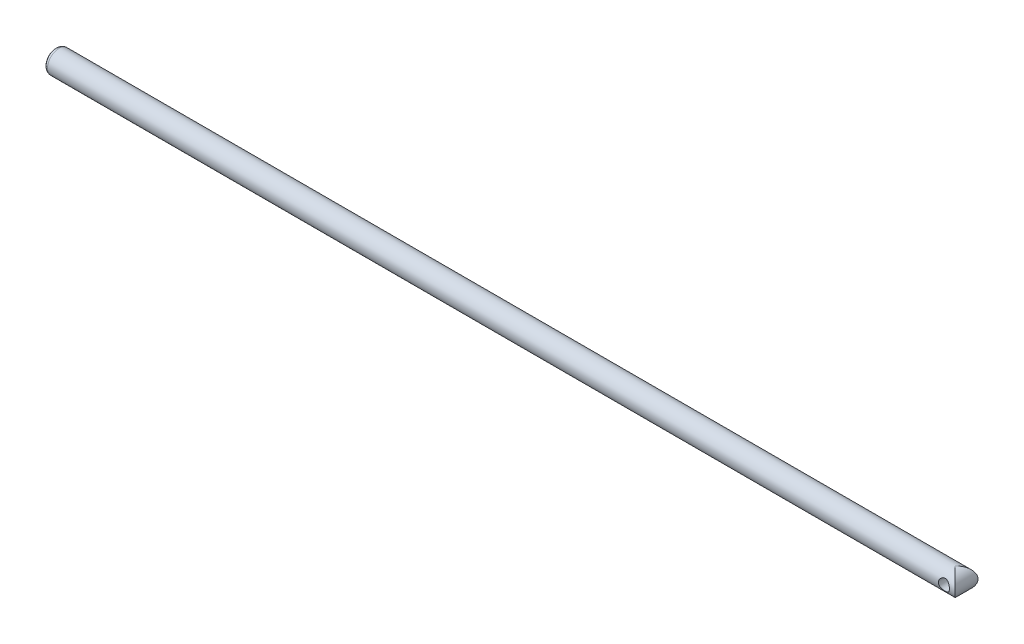
ISO-10303-21;
HEADER;
FILE_DESCRIPTION(('STEP AP214'),'2;1');
FILE_NAME('part.step','',(''),(''),'','','');
FILE_SCHEMA(('AUTOMOTIVE_DESIGN { 1 0 10303 214 1 1 1 1 }'));
ENDSEC;
DATA;
#1=APPLICATION_CONTEXT('core data for automotive mechanical design processes');
#2=APPLICATION_PROTOCOL_DEFINITION('international standard','automotive_design',2000,#1);
#3=PRODUCT_CONTEXT('',#1,'mechanical');
#4=PRODUCT('Part','Part','',(#3));
#5=PRODUCT_RELATED_PRODUCT_CATEGORY('part','',(#4));
#6=PRODUCT_DEFINITION_FORMATION('','',#4);
#7=PRODUCT_DEFINITION_CONTEXT('part definition',#1,'design');
#8=PRODUCT_DEFINITION('design','',#6,#7);
#9=PRODUCT_DEFINITION_SHAPE('','',#8);
#10=(LENGTH_UNIT() NAMED_UNIT(*) SI_UNIT(.MILLI.,.METRE.));
#11=(NAMED_UNIT(*) PLANE_ANGLE_UNIT() SI_UNIT($,.RADIAN.));
#12=(NAMED_UNIT(*) SI_UNIT($,.STERADIAN.) SOLID_ANGLE_UNIT());
#13=UNCERTAINTY_MEASURE_WITH_UNIT(LENGTH_MEASURE(1.E-05),#10,'distance_accuracy_value','');
#14=(GEOMETRIC_REPRESENTATION_CONTEXT(3) GLOBAL_UNCERTAINTY_ASSIGNED_CONTEXT((#13)) GLOBAL_UNIT_ASSIGNED_CONTEXT((#10,
#11,#12)) REPRESENTATION_CONTEXT('',''));
#15=CARTESIAN_POINT('',(0.,0.,0.));
#16=DIRECTION('',(0.,0.,1.));
#17=DIRECTION('',(1.,0.,0.));
#18=AXIS2_PLACEMENT_3D('',#15,#16,#17);
#19=CARTESIAN_POINT('',(180.,0.,0.));
#20=DIRECTION('',(-1.,0.,0.));
#21=DIRECTION('',(0.,0.,1.));
#22=AXIS2_PLACEMENT_3D('',#19,#20,#21);
#23=CYLINDRICAL_SURFACE('',#22,2.25);
#24=CARTESIAN_POINT('',(178.85,0.,-2.25));
#25=CARTESIAN_POINT('',(178.849996483884,0.0579821590456364,-2.24999697976081));
#26=CARTESIAN_POINT('',(178.845388572671,0.116037996210476,-2.24773444568586));
#27=CARTESIAN_POINT('',(178.827156167325,0.230443456518031,-2.23890691047839));
#28=CARTESIAN_POINT('',(178.813513560914,0.286789413989171,-2.23233326691996));
#29=CARTESIAN_POINT('',(178.777867685626,0.395943720017981,-2.21557360125293));
#30=CARTESIAN_POINT('',(178.755896417056,0.448764709898519,-2.20540141529391));
#31=CARTESIAN_POINT('',(178.704377655597,0.549897174510552,-2.18238554853706));
#32=CARTESIAN_POINT('',(178.674830981373,0.598209135757806,-2.16954215644127));
#33=CARTESIAN_POINT('',(178.607026915551,0.692137069100555,-2.14149188153819));
#34=CARTESIAN_POINT('',(178.568360612245,0.737429273098812,-2.12619061401167));
#35=CARTESIAN_POINT('',(178.484292302774,0.821181945341928,-2.09527016106782));
#36=CARTESIAN_POINT('',(178.438885448634,0.859637452349944,-2.07965075387078));
#37=CARTESIAN_POINT('',(178.338627142111,0.931446111885274,-2.04854830138448));
#38=CARTESIAN_POINT('',(178.283327390723,0.964218737112957,-2.03315915188604));
#39=CARTESIAN_POINT('',(178.167163525345,1.01985964544337,-2.00582994974276));
#40=CARTESIAN_POINT('',(178.106303287772,1.04273476560258,-1.99388751805888));
#41=CARTESIAN_POINT('',(177.984401004109,1.07648286398214,-1.97586277223826));
#42=CARTESIAN_POINT('',(177.92357898332,1.0879810990606,-1.96947783363715));
#43=CARTESIAN_POINT('',(177.80056132098,1.10057119373046,-1.96247318978129));
#44=CARTESIAN_POINT('',(177.738366984684,1.10167254782558,-1.96184822449137));
#45=CARTESIAN_POINT('',(177.621923264895,1.09389762959857,-1.96618866729185));
#46=CARTESIAN_POINT('',(177.5675707064,1.08613547407838,-1.97052994669977));
#47=CARTESIAN_POINT('',(177.461067221651,1.06277536581836,-1.98322550968787));
#48=CARTESIAN_POINT('',(177.40891695195,1.04717509398141,-1.99158098093214));
#49=CARTESIAN_POINT('',(177.306816954156,1.00828796659606,-2.01155175347459));
#50=CARTESIAN_POINT('',(177.256946900191,0.984830348180948,-2.02323852826611));
#51=CARTESIAN_POINT('',(177.161616477379,0.931023204232438,-2.04855532270784));
#52=CARTESIAN_POINT('',(177.11615809222,0.900670598703719,-2.06218620977854));
#53=CARTESIAN_POINT('',(177.025173467148,0.829665462505288,-2.09184262968309));
#54=CARTESIAN_POINT('',(176.980299316676,0.788212463782174,-2.1079587771804));
#55=CARTESIAN_POINT('',(176.897875271527,0.698287564717992,-2.13943073484585));
#56=CARTESIAN_POINT('',(176.860328587623,0.649812603608778,-2.15478620951091));
#57=CARTESIAN_POINT('',(176.792132272049,0.544593387609771,-2.18380793096712));
#58=CARTESIAN_POINT('',(176.761844487318,0.487584874570581,-2.19737438153352));
#59=CARTESIAN_POINT('',(176.71153144344,0.368449525417393,-2.22045371872629));
#60=CARTESIAN_POINT('',(176.691498375587,0.306326625750757,-2.22996968875761));
#61=CARTESIAN_POINT('',(176.663850344706,0.184079560080382,-2.24323139023487));
#62=CARTESIAN_POINT('',(176.655367037309,0.124195769581111,-2.24737927133403));
#63=CARTESIAN_POINT('',(176.648354814981,0.00371944305051678,-2.25080232834235));
#64=CARTESIAN_POINT('',(176.649821487401,-0.0568727669082567,-2.25007966425819));
#65=CARTESIAN_POINT('',(176.662145810204,-0.172325331070322,-2.24408171391916));
#66=CARTESIAN_POINT('',(176.67230660805,-0.227280073508433,-2.2391443152301));
#67=CARTESIAN_POINT('',(176.700655628438,-0.334601010774709,-2.22563895472564));
#68=CARTESIAN_POINT('',(176.718844753866,-0.386966913718056,-2.21707058456552));
#69=CARTESIAN_POINT('',(176.763239936766,-0.489400887609939,-2.19676922998554));
#70=CARTESIAN_POINT('',(176.789666302371,-0.539355881983171,-2.18495048480504));
#71=CARTESIAN_POINT('',(176.849540993007,-0.634292495194559,-2.15930428329395));
#72=CARTESIAN_POINT('',(176.882992359049,-0.679271947283572,-2.14547595784911));
#73=CARTESIAN_POINT('',(176.95963501468,-0.767498218919079,-2.11561237466102));
#74=CARTESIAN_POINT('',(177.003449083576,-0.810176361486827,-2.09949218318878));
#75=CARTESIAN_POINT('',(177.097688859055,-0.887818028221786,-2.06785890162469));
#76=CARTESIAN_POINT('',(177.14811861457,-0.922776792531088,-2.05234619093474));
#77=CARTESIAN_POINT('',(177.256909391827,-0.985374928334967,-2.02306290870064));
#78=CARTESIAN_POINT('',(177.315517332725,-1.01263744649297,-2.00939518190377));
#79=CARTESIAN_POINT('',(177.43737640799,-1.05662142200084,-1.98662380082214));
#80=CARTESIAN_POINT('',(177.500621720332,-1.07335585224274,-1.97751453237041));
#81=CARTESIAN_POINT('',(177.623560394596,-1.09431546486678,-1.96598673741067));
#82=CARTESIAN_POINT('',(177.683025409756,-1.09957244847487,-1.96301775171982));
#83=CARTESIAN_POINT('',(177.80203212833,-1.1003768067568,-1.96256797183108));
#84=CARTESIAN_POINT('',(177.861573794719,-1.0959278142328,-1.96508512425314));
#85=CARTESIAN_POINT('',(177.973573888665,-1.07840005931942,-1.97474996083055));
#86=CARTESIAN_POINT('',(178.026196666662,-1.06610924087696,-1.98147386097546));
#87=CARTESIAN_POINT('',(178.128587168129,-1.03419029270671,-1.99831782557131));
#88=CARTESIAN_POINT('',(178.178353996064,-1.01455987585523,-2.00843894854476));
#89=CARTESIAN_POINT('',(178.277313545343,-0.967033540277184,-2.03177021921371));
#90=CARTESIAN_POINT('',(178.32624276692,-0.93867068761989,-2.04514228701405));
#91=CARTESIAN_POINT('',(178.418961751134,-0.875017739653341,-2.07317463719336));
#92=CARTESIAN_POINT('',(178.462748896351,-0.839724140670926,-2.08783556904769));
#93=CARTESIAN_POINT('',(178.549135567162,-0.758476759672322,-2.11879911030182));
#94=CARTESIAN_POINT('',(178.591028181305,-0.711765817963947,-2.13509796172773));
#95=CARTESIAN_POINT('',(178.666522098764,-0.611494175931689,-2.16594644532506));
#96=CARTESIAN_POINT('',(178.700119148693,-0.557929983017699,-2.18049517820547));
#97=CARTESIAN_POINT('',(178.757952991647,-0.44504235821319,-2.20630849860692));
#98=CARTESIAN_POINT('',(178.782166764881,-0.38570520379662,-2.21756499298024));
#99=CARTESIAN_POINT('',(178.819965815321,-0.263169770535705,-2.23540720769536));
#100=CARTESIAN_POINT('',(178.833581810281,-0.199983227579467,-2.24200642197857));
#101=CARTESIAN_POINT('',(178.844366843892,-0.113493599049666,-2.24725068525953));
#102=CARTESIAN_POINT('',(178.846476546886,-0.0908625875781861,-2.24827922014213));
#103=CARTESIAN_POINT('',(178.849293833326,-0.0454915006565043,-2.24965447908234));
#104=CARTESIAN_POINT('',(178.850001379677,-0.0227514223367693,-2.25000118510139));
#105=CARTESIAN_POINT('',(178.85,0.,-2.25));
#106=B_SPLINE_CURVE_WITH_KNOTS('',3,(#24,#25,#26,#27,#28,#29,#30,#31,#32,#33,#34,#35,#36,#37,
#38,#39,#40,#41,#42,#43,#44,#45,#46,#47,#48,#49,#50,#51,#52,#53,#54,#55,#56,#57,#58,#59,#60,#61,
#62,#63,#64,#65,#66,#67,#68,#69,#70,#71,#72,#73,#74,#75,#76,#77,#78,#79,#80,#81,#82,#83,#84,#85,
#86,#87,#88,#89,#90,#91,#92,#93,#94,#95,#96,#97,#98,#99,#100,#101,#102,#103,#104,#105),
.UNSPECIFIED.,.T.,.F.,(4,2,2,2,2,2,2,2,2,2,2,2,2,2,2,2,2,2,2,2,2,2,2,2,2,2,2,2,2,2,2,2,2,2,2,2,
2,2,2,2,4),(0.,0.173853950581156,0.348057493703002,0.521598388511485,0.695120536882141,
0.878808628819389,1.06262947974447,1.25992281591878,1.45707964620923,1.64267285633092,
1.82809656503372,1.99255389652706,2.15705991539637,2.32540210852827,2.49381964862033,
2.68253457755973,2.87133201341859,3.06817024323509,3.26485836193409,3.44574503659065,
3.62655149626296,3.79409329353385,3.96165393781988,4.1341488802086,4.30671864740243,
4.49565124527471,4.68470001785891,4.88183172520614,5.07872004522305,5.2570209546737,
5.43525514020224,5.5979170145254,5.76062961891444,5.93428055960331,6.10801951241568,
6.30160301092233,6.49528556039244,6.6894403036427,6.88303016999391,6.95124632611164,
7.01946428694119),.UNSPECIFIED.);
#107=CARTESIAN_POINT('',(178.85,0.,-2.25));
#108=VERTEX_POINT('',#107);
#109=EDGE_CURVE('E12',#108,#108,#106,.T.);
#110=ORIENTED_EDGE('',*,*,#109,.T.);
#111=EDGE_LOOP('',(#110));
#112=FACE_BOUND('',#111,.T.);
#113=CARTESIAN_POINT('',(178.85,0.,2.25));
#114=CARTESIAN_POINT('',(178.849996483884,-0.0579821590456364,2.24999697976081));
#115=CARTESIAN_POINT('',(178.845388572671,-0.116037996210476,2.24773444568586));
#116=CARTESIAN_POINT('',(178.827156167325,-0.230443456518031,2.23890691047839));
#117=CARTESIAN_POINT('',(178.813513560914,-0.286789413989171,2.23233326691996));
#118=CARTESIAN_POINT('',(178.777867685626,-0.395943720017981,2.21557360125293));
#119=CARTESIAN_POINT('',(178.755896417056,-0.448764709898519,2.20540141529391));
#120=CARTESIAN_POINT('',(178.704377655597,-0.549897174510552,2.18238554853706));
#121=CARTESIAN_POINT('',(178.674830981373,-0.598209135757806,2.16954215644127));
#122=CARTESIAN_POINT('',(178.607026915551,-0.692137069100555,2.14149188153819));
#123=CARTESIAN_POINT('',(178.568360612245,-0.737429273098812,2.12619061401167));
#124=CARTESIAN_POINT('',(178.484292302774,-0.821181945341928,2.09527016106782));
#125=CARTESIAN_POINT('',(178.438885448634,-0.859637452349944,2.07965075387078));
#126=CARTESIAN_POINT('',(178.338627142111,-0.931446111885274,2.04854830138448));
#127=CARTESIAN_POINT('',(178.283327390723,-0.964218737112957,2.03315915188604));
#128=CARTESIAN_POINT('',(178.167163525345,-1.01985964544337,2.00582994974276));
#129=CARTESIAN_POINT('',(178.106303287772,-1.04273476560258,1.99388751805888));
#130=CARTESIAN_POINT('',(177.984401004109,-1.07648286398214,1.97586277223826));
#131=CARTESIAN_POINT('',(177.92357898332,-1.0879810990606,1.96947783363715));
#132=CARTESIAN_POINT('',(177.80056132098,-1.10057119373046,1.96247318978129));
#133=CARTESIAN_POINT('',(177.738366984684,-1.10167254782558,1.96184822449137));
#134=CARTESIAN_POINT('',(177.621923264895,-1.09389762959857,1.96618866729185));
#135=CARTESIAN_POINT('',(177.5675707064,-1.08613547407838,1.97052994669977));
#136=CARTESIAN_POINT('',(177.461067221651,-1.06277536581836,1.98322550968787));
#137=CARTESIAN_POINT('',(177.40891695195,-1.04717509398141,1.99158098093214));
#138=CARTESIAN_POINT('',(177.306816954156,-1.00828796659606,2.01155175347459));
#139=CARTESIAN_POINT('',(177.256946900191,-0.984830348180948,2.02323852826611));
#140=CARTESIAN_POINT('',(177.161616477379,-0.931023204232438,2.04855532270784));
#141=CARTESIAN_POINT('',(177.11615809222,-0.900670598703719,2.06218620977854));
#142=CARTESIAN_POINT('',(177.025173467148,-0.829665462505288,2.09184262968309));
#143=CARTESIAN_POINT('',(176.980299316676,-0.788212463782174,2.1079587771804));
#144=CARTESIAN_POINT('',(176.897875271527,-0.698287564717992,2.13943073484585));
#145=CARTESIAN_POINT('',(176.860328587623,-0.649812603608778,2.15478620951091));
#146=CARTESIAN_POINT('',(176.792132272049,-0.544593387609771,2.18380793096712));
#147=CARTESIAN_POINT('',(176.761844487318,-0.487584874570581,2.19737438153352));
#148=CARTESIAN_POINT('',(176.71153144344,-0.368449525417393,2.22045371872629));
#149=CARTESIAN_POINT('',(176.691498375587,-0.306326625750757,2.22996968875761));
#150=CARTESIAN_POINT('',(176.663850344706,-0.184079560080382,2.24323139023487));
#151=CARTESIAN_POINT('',(176.655367037309,-0.124195769581111,2.24737927133403));
#152=CARTESIAN_POINT('',(176.648354814981,-0.00371944305051678,2.25080232834235));
#153=CARTESIAN_POINT('',(176.649821487401,0.0568727669082567,2.25007966425819));
#154=CARTESIAN_POINT('',(176.662145810204,0.172325331070322,2.24408171391916));
#155=CARTESIAN_POINT('',(176.67230660805,0.227280073508433,2.2391443152301));
#156=CARTESIAN_POINT('',(176.700655628438,0.334601010774709,2.22563895472564));
#157=CARTESIAN_POINT('',(176.718844753866,0.386966913718056,2.21707058456552));
#158=CARTESIAN_POINT('',(176.763239936766,0.489400887609939,2.19676922998554));
#159=CARTESIAN_POINT('',(176.789666302371,0.539355881983171,2.18495048480504));
#160=CARTESIAN_POINT('',(176.849540993007,0.634292495194559,2.15930428329395));
#161=CARTESIAN_POINT('',(176.882992359049,0.679271947283572,2.14547595784911));
#162=CARTESIAN_POINT('',(176.95963501468,0.767498218919079,2.11561237466102));
#163=CARTESIAN_POINT('',(177.003449083576,0.810176361486827,2.09949218318878));
#164=CARTESIAN_POINT('',(177.097688859055,0.887818028221786,2.06785890162469));
#165=CARTESIAN_POINT('',(177.14811861457,0.922776792531088,2.05234619093474));
#166=CARTESIAN_POINT('',(177.256909391827,0.985374928334967,2.02306290870064));
#167=CARTESIAN_POINT('',(177.315517332725,1.01263744649297,2.00939518190377));
#168=CARTESIAN_POINT('',(177.43737640799,1.05662142200084,1.98662380082214));
#169=CARTESIAN_POINT('',(177.500621720332,1.07335585224274,1.97751453237041));
#170=CARTESIAN_POINT('',(177.623560394596,1.09431546486678,1.96598673741067));
#171=CARTESIAN_POINT('',(177.683025409756,1.09957244847487,1.96301775171982));
#172=CARTESIAN_POINT('',(177.80203212833,1.1003768067568,1.96256797183108));
#173=CARTESIAN_POINT('',(177.861573794719,1.0959278142328,1.96508512425314));
#174=CARTESIAN_POINT('',(177.973573888665,1.07840005931942,1.97474996083055));
#175=CARTESIAN_POINT('',(178.026196666662,1.06610924087696,1.98147386097546));
#176=CARTESIAN_POINT('',(178.128587168129,1.03419029270671,1.99831782557131));
#177=CARTESIAN_POINT('',(178.178353996064,1.01455987585523,2.00843894854476));
#178=CARTESIAN_POINT('',(178.277313545343,0.967033540277184,2.03177021921371));
#179=CARTESIAN_POINT('',(178.32624276692,0.93867068761989,2.04514228701405));
#180=CARTESIAN_POINT('',(178.418961751134,0.875017739653341,2.07317463719336));
#181=CARTESIAN_POINT('',(178.462748896351,0.839724140670926,2.08783556904769));
#182=CARTESIAN_POINT('',(178.549135567162,0.758476759672322,2.11879911030182));
#183=CARTESIAN_POINT('',(178.591028181305,0.711765817963947,2.13509796172773));
#184=CARTESIAN_POINT('',(178.666522098764,0.611494175931689,2.16594644532506));
#185=CARTESIAN_POINT('',(178.700119148693,0.557929983017699,2.18049517820547));
#186=CARTESIAN_POINT('',(178.757952991647,0.44504235821319,2.20630849860692));
#187=CARTESIAN_POINT('',(178.782166764881,0.38570520379662,2.21756499298024));
#188=CARTESIAN_POINT('',(178.819965815321,0.263169770535705,2.23540720769536));
#189=CARTESIAN_POINT('',(178.833581810281,0.199983227579467,2.24200642197857));
#190=CARTESIAN_POINT('',(178.844366843892,0.113493599049666,2.24725068525953));
#191=CARTESIAN_POINT('',(178.846476546886,0.0908625875781861,2.24827922014213));
#192=CARTESIAN_POINT('',(178.849293833326,0.0454915006565043,2.24965447908234));
#193=CARTESIAN_POINT('',(178.850001379677,0.0227514223367693,2.25000118510139));
#194=CARTESIAN_POINT('',(178.85,0.,2.25));
#195=B_SPLINE_CURVE_WITH_KNOTS('',3,(#113,#114,#115,#116,#117,#118,#119,#120,#121,#122,#123,
#124,#125,#126,#127,#128,#129,#130,#131,#132,#133,#134,#135,#136,#137,#138,#139,#140,#141,#142,
#143,#144,#145,#146,#147,#148,#149,#150,#151,#152,#153,#154,#155,#156,#157,#158,#159,#160,#161,
#162,#163,#164,#165,#166,#167,#168,#169,#170,#171,#172,#173,#174,#175,#176,#177,#178,#179,#180,
#181,#182,#183,#184,#185,#186,#187,#188,#189,#190,#191,#192,#193,#194),.UNSPECIFIED.,.T.,.F.,(4,
2,2,2,2,2,2,2,2,2,2,2,2,2,2,2,2,2,2,2,2,2,2,2,2,2,2,2,2,2,2,2,2,2,2,2,2,2,2,2,4),(0.,
0.173853950581156,0.348057493703002,0.521598388511485,0.695120536882141,0.878808628819389,
1.06262947974447,1.25992281591878,1.45707964620923,1.64267285633092,1.82809656503372,
1.99255389652706,2.15705991539637,2.32540210852827,2.49381964862033,2.68253457755973,
2.87133201341859,3.06817024323509,3.26485836193409,3.44574503659065,3.62655149626296,
3.79409329353385,3.96165393781988,4.1341488802086,4.30671864740243,4.49565124527471,
4.68470001785891,4.88183172520614,5.07872004522305,5.2570209546737,5.43525514020224,
5.5979170145254,5.76062961891444,5.93428055960331,6.10801951241568,6.30160301092233,
6.49528556039244,6.6894403036427,6.88303016999391,6.95124632611164,7.01946428694119),.UNSPECIFIED.);
#196=CARTESIAN_POINT('',(178.85,0.,2.25));
#197=VERTEX_POINT('',#196);
#198=EDGE_CURVE('E95',#197,#197,#195,.T.);
#199=ORIENTED_EDGE('',*,*,#198,.T.);
#200=EDGE_LOOP('',(#199));
#201=FACE_BOUND('',#200,.T.);
#202=CARTESIAN_POINT('',(177.75,0.,0.));
#203=DIRECTION('',(-0.707106781186547,0.,-0.707106781186548));
#204=DIRECTION('',(-0.707106781186547,0.,0.707106781186548));
#205=AXIS2_PLACEMENT_3D('',#202,#203,#204);
#206=ELLIPSE('',#205,3.18198051533946,2.25);
#207=CARTESIAN_POINT('',(177.75,2.25,0.));
#208=VERTEX_POINT('',#207);
#209=CARTESIAN_POINT('',(177.75,-2.25,0.));
#210=VERTEX_POINT('',#209);
#211=EDGE_CURVE('E101',#208,#210,#206,.T.);
#212=ORIENTED_EDGE('',*,*,#211,.T.);
#213=CARTESIAN_POINT('',(177.75,0.,0.));
#214=DIRECTION('',(-0.707106781186547,0.,0.707106781186548));
#215=DIRECTION('',(-0.707106781186547,0.,-0.707106781186548));
#216=AXIS2_PLACEMENT_3D('',#213,#214,#215);
#217=ELLIPSE('',#216,3.18198051533946,2.25);
#218=EDGE_CURVE('E105',#210,#208,#217,.T.);
#219=ORIENTED_EDGE('',*,*,#218,.T.);
#220=EDGE_LOOP('',(#212,#219));
#221=FACE_BOUND('',#220,.T.);
#222=CARTESIAN_POINT('',(0.749999999999973,0.,0.));
#223=DIRECTION('',(1.,0.,0.));
#224=DIRECTION('',(0.,0.,-1.));
#225=AXIS2_PLACEMENT_3D('',#222,#223,#224);
#226=CIRCLE('',#225,2.25);
#227=CARTESIAN_POINT('',(0.749999999999973,0.,-2.25));
#228=VERTEX_POINT('',#227);
#229=EDGE_CURVE('E108',#228,#228,#226,.T.);
#230=ORIENTED_EDGE('',*,*,#229,.T.);
#231=EDGE_LOOP('',(#230));
#232=FACE_BOUND('',#231,.T.);
#233=ADVANCED_FACE('F84',(#112,#201,#221,#232),#23,.T.);
#234=CARTESIAN_POINT('',(0.,0.,0.));
#235=DIRECTION('',(1.,0.,0.));
#236=DIRECTION('',(0.,0.,-1.));
#237=AXIS2_PLACEMENT_3D('',#234,#235,#236);
#238=PLANE('',#237);
#239=CARTESIAN_POINT('',(0.,0.,0.));
#240=DIRECTION('',(1.,0.,0.));
#241=DIRECTION('',(0.,0.,-1.));
#242=AXIS2_PLACEMENT_3D('',#239,#240,#241);
#243=CIRCLE('',#242,1.5);
#244=CARTESIAN_POINT('',(0.,0.,-1.5));
#245=VERTEX_POINT('',#244);
#246=EDGE_CURVE('E111',#245,#245,#243,.F.);
#247=ORIENTED_EDGE('',*,*,#246,.T.);
#248=EDGE_LOOP('',(#247));
#249=FACE_BOUND('',#248,.T.);
#250=ADVANCED_FACE('F127',(#249),#238,.F.);
#251=CARTESIAN_POINT('',(0.750000000000001,0.,0.));
#252=DIRECTION('',(1.,0.,0.));
#253=DIRECTION('',(0.,0.,-1.));
#254=AXIS2_PLACEMENT_3D('',#251,#252,#253);
#255=TOROIDAL_SURFACE('',#254,1.5,0.75);
#256=ORIENTED_EDGE('',*,*,#246,.F.);
#257=EDGE_LOOP('',(#256));
#258=FACE_BOUND('',#257,.T.);
#259=ORIENTED_EDGE('',*,*,#229,.F.);
#260=EDGE_LOOP('',(#259));
#261=FACE_BOUND('',#260,.T.);
#262=ADVANCED_FACE('F86',(#258,#261),#255,.T.);
#263=CARTESIAN_POINT('',(177.75,0.,-2.25));
#264=DIRECTION('',(0.,0.,1.));
#265=DIRECTION('',(1.,0.,0.));
#266=AXIS2_PLACEMENT_3D('',#263,#264,#265);
#267=CYLINDRICAL_SURFACE('',#266,2.25);
#268=ORIENTED_EDGE('',*,*,#218,.F.);
#269=ORIENTED_EDGE('',*,*,#211,.F.);
#270=EDGE_LOOP('',(#268,#269));
#271=FACE_BOUND('',#270,.T.);
#272=ADVANCED_FACE('F107',(#271),#267,.T.);
#273=CARTESIAN_POINT('',(177.75,0.,-2.25));
#274=DIRECTION('',(0.,0.,1.));
#275=DIRECTION('',(1.,0.,0.));
#276=AXIS2_PLACEMENT_3D('',#273,#274,#275);
#277=CYLINDRICAL_SURFACE('',#276,1.09999999999999);
#278=ORIENTED_EDGE('',*,*,#198,.F.);
#279=EDGE_LOOP('',(#278));
#280=FACE_BOUND('',#279,.T.);
#281=ORIENTED_EDGE('',*,*,#109,.F.);
#282=EDGE_LOOP('',(#281));
#283=FACE_BOUND('',#282,.T.);
#284=ADVANCED_FACE('F120',(#280,#283),#277,.F.);
#285=CLOSED_SHELL('',(#233,#250,#262,#272,#284));
#286=MANIFOLD_SOLID_BREP('B2',#285);
#287=ADVANCED_BREP_SHAPE_REPRESENTATION('',(#18,#286),#14);
#288=SHAPE_DEFINITION_REPRESENTATION(#9,#287);
ENDSEC;
END-ISO-10303-21;
